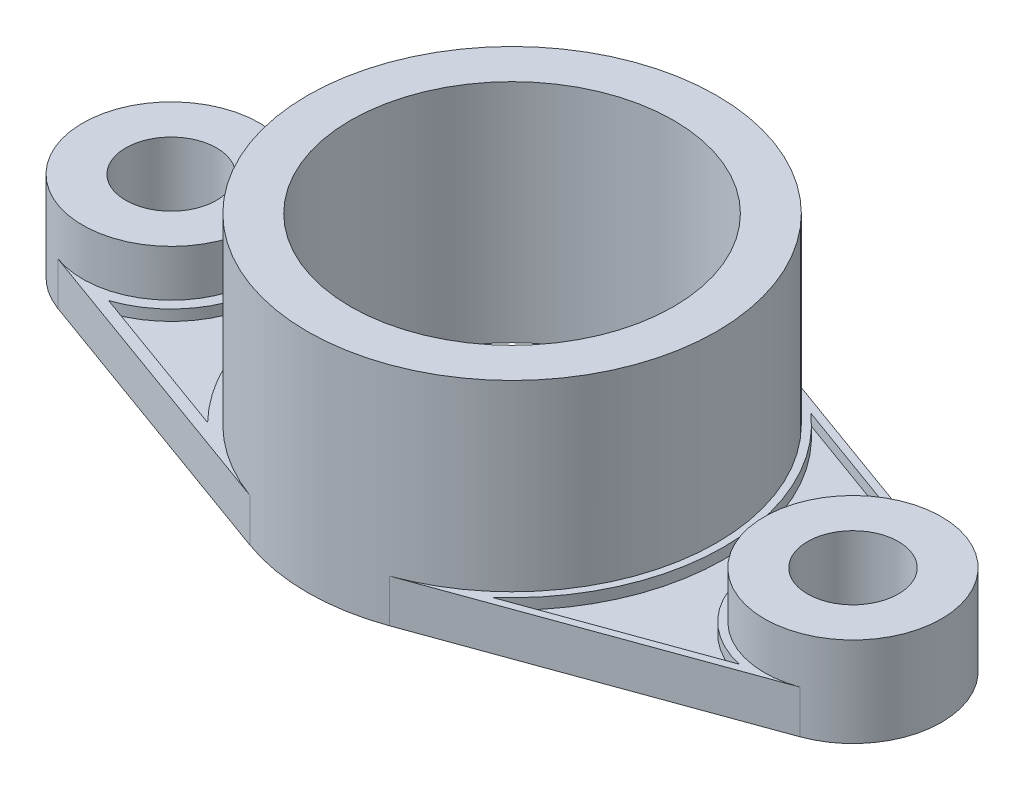
ISO-10303-21;
HEADER;
FILE_DESCRIPTION(('STEP AP214'),'2;1');
FILE_NAME('part.step','',(''),(''),'','','');
FILE_SCHEMA(('AUTOMOTIVE_DESIGN { 1 0 10303 214 1 1 1 1 }'));
ENDSEC;
DATA;
#1=APPLICATION_CONTEXT('core data for automotive mechanical design processes');
#2=APPLICATION_PROTOCOL_DEFINITION('international standard','automotive_design',2000,#1);
#3=PRODUCT_CONTEXT('',#1,'mechanical');
#4=PRODUCT('Part','Part','',(#3));
#5=PRODUCT_RELATED_PRODUCT_CATEGORY('part','',(#4));
#6=PRODUCT_DEFINITION_FORMATION('','',#4);
#7=PRODUCT_DEFINITION_CONTEXT('part definition',#1,'design');
#8=PRODUCT_DEFINITION('design','',#6,#7);
#9=PRODUCT_DEFINITION_SHAPE('','',#8);
#10=(LENGTH_UNIT() NAMED_UNIT(*) SI_UNIT(.MILLI.,.METRE.));
#11=(NAMED_UNIT(*) PLANE_ANGLE_UNIT() SI_UNIT($,.RADIAN.));
#12=(NAMED_UNIT(*) SI_UNIT($,.STERADIAN.) SOLID_ANGLE_UNIT());
#13=UNCERTAINTY_MEASURE_WITH_UNIT(LENGTH_MEASURE(1.E-05),#10,'distance_accuracy_value','');
#14=(GEOMETRIC_REPRESENTATION_CONTEXT(3) GLOBAL_UNCERTAINTY_ASSIGNED_CONTEXT((#13)) GLOBAL_UNIT_ASSIGNED_CONTEXT((#10,
#11,#12)) REPRESENTATION_CONTEXT('',''));
#15=CARTESIAN_POINT('',(0.,0.,0.));
#16=DIRECTION('',(0.,0.,1.));
#17=DIRECTION('',(1.,0.,0.));
#18=AXIS2_PLACEMENT_3D('',#15,#16,#17);
#19=CARTESIAN_POINT('',(0.,12.,0.));
#20=DIRECTION('',(0.,1.,0.));
#21=DIRECTION('',(0.,0.,1.));
#22=AXIS2_PLACEMENT_3D('',#19,#20,#21);
#23=PLANE('',#22);
#24=CARTESIAN_POINT('',(0.,12.,0.));
#25=DIRECTION('',(0.,-1.,0.));
#26=DIRECTION('',(0.,0.,1.));
#27=AXIS2_PLACEMENT_3D('',#24,#25,#26);
#28=CIRCLE('',#27,60.);
#29=CARTESIAN_POINT('',(-42.9709443550318,12.,41.8747888500558));
#30=VERTEX_POINT('',#29);
#31=CARTESIAN_POINT('',(-42.9709443550318,12.,-41.8747888500558));
#32=VERTEX_POINT('',#31);
#33=EDGE_CURVE('E54',#30,#32,#28,.T.);
#34=ORIENTED_EDGE('',*,*,#33,.F.);
#35=DIRECTION('',(0.940298506004326,0.,0.340350877192983));
#36=VECTOR('',#35,1.);
#37=CARTESIAN_POINT('',(-86.1967618123211,12.,26.228752197835));
#38=LINE('',#37,#36);
#39=CARTESIAN_POINT('',(-86.1967618123211,12.,26.228752197835));
#40=VERTEX_POINT('',#39);
#41=EDGE_CURVE('E171',#40,#30,#38,.T.);
#42=ORIENTED_EDGE('',*,*,#41,.F.);
#43=CARTESIAN_POINT('',(-95.,12.,0.));
#44=DIRECTION('',(0.,-1.,0.));
#45=DIRECTION('',(0.,0.,1.));
#46=AXIS2_PLACEMENT_3D('',#43,#44,#45);
#47=CIRCLE('',#46,27.6666666666667);
#48=CARTESIAN_POINT('',(-86.1967618123211,12.,-26.228752197835));
#49=VERTEX_POINT('',#48);
#50=EDGE_CURVE('E174',#49,#40,#47,.T.);
#51=ORIENTED_EDGE('',*,*,#50,.F.);
#52=DIRECTION('',(-0.940298506004326,0.,0.340350877192982));
#53=VECTOR('',#52,1.);
#54=CARTESIAN_POINT('',(-42.9709443550318,12.,-41.8747888500558));
#55=LINE('',#54,#53);
#56=EDGE_CURVE('E180',#32,#49,#55,.T.);
#57=ORIENTED_EDGE('',*,*,#56,.F.);
#58=EDGE_LOOP('',(#34,#42,#51,#57));
#59=FACE_BOUND('',#58,.T.);
#60=DIRECTION('',(0.940298506004326,0.,-0.340350877192982));
#61=VECTOR('',#60,1.);
#62=CARTESIAN_POINT('',(-19.4,12.,-53.5970148422466));
#63=LINE('',#62,#61);
#64=CARTESIAN_POINT('',(-103.395321637427,12.,-23.1940298147734));
#65=VERTEX_POINT('',#64);
#66=CARTESIAN_POINT('',(-19.4,12.,-53.5970148422466));
#67=VERTEX_POINT('',#66);
#68=EDGE_CURVE('E246',#65,#67,#63,.T.);
#69=ORIENTED_EDGE('',*,*,#68,.F.);
#70=CARTESIAN_POINT('',(-95.,12.,0.));
#71=DIRECTION('',(0.,1.,0.));
#72=DIRECTION('',(0.,0.,1.));
#73=AXIS2_PLACEMENT_3D('',#70,#71,#72);
#74=CIRCLE('',#73,24.6666666666667);
#75=CARTESIAN_POINT('',(-103.395321637427,12.,23.1940298147734));
#76=VERTEX_POINT('',#75);
#77=EDGE_CURVE('E11',#65,#76,#74,.F.);
#78=ORIENTED_EDGE('',*,*,#77,.T.);
#79=DIRECTION('',(0.940298506004326,0.,0.340350877192983));
#80=VECTOR('',#79,1.);
#81=CARTESIAN_POINT('',(-19.4,12.,53.5970148422466));
#82=LINE('',#81,#80);
#83=CARTESIAN_POINT('',(-19.4,12.,53.5970148422466));
#84=VERTEX_POINT('',#83);
#85=EDGE_CURVE('E250',#76,#84,#82,.T.);
#86=ORIENTED_EDGE('',*,*,#85,.T.);
#87=CARTESIAN_POINT('',(0.,12.,0.));
#88=DIRECTION('',(0.,1.,0.));
#89=DIRECTION('',(0.,0.,1.));
#90=AXIS2_PLACEMENT_3D('',#87,#88,#89);
#91=CIRCLE('',#90,57.);
#92=EDGE_CURVE('E47',#67,#84,#91,.T.);
#93=ORIENTED_EDGE('',*,*,#92,.F.);
#94=EDGE_LOOP('',(#69,#78,#86,#93));
#95=FACE_BOUND('',#94,.T.);
#96=ADVANCED_FACE('F39',(#59,#95),#23,.T.);
#97=CARTESIAN_POINT('',(0.,12.,0.));
#98=DIRECTION('',(0.,-1.,0.));
#99=DIRECTION('',(0.,0.,1.));
#100=AXIS2_PLACEMENT_3D('',#97,#98,#99);
#101=CIRCLE('',#100,59.);
#102=CARTESIAN_POINT('',(38.7985797033667,12.,-44.448511932364));
#103=VERTEX_POINT('',#102);
#104=CARTESIAN_POINT('',(38.7985797033667,12.,44.448511932364));
#105=VERTEX_POINT('',#104);
#106=EDGE_CURVE('E62',#103,#105,#101,.T.);
#107=ORIENTED_EDGE('',*,*,#106,.F.);
#108=DIRECTION('',(-0.940298506004326,0.,-0.340350877192982));
#109=VECTOR('',#108,1.);
#110=CARTESIAN_POINT('',(89.5057405715925,12.,-26.0945247982113));
#111=LINE('',#110,#109);
#112=CARTESIAN_POINT('',(89.5057405715925,12.,-26.0945247982113));
#113=VERTEX_POINT('',#112);
#114=EDGE_CURVE('E195',#113,#103,#111,.T.);
#115=ORIENTED_EDGE('',*,*,#114,.F.);
#116=CARTESIAN_POINT('',(95.,12.,0.));
#117=DIRECTION('',(0.,-1.,0.));
#118=DIRECTION('',(0.,0.,1.));
#119=AXIS2_PLACEMENT_3D('',#116,#117,#118);
#120=CIRCLE('',#119,26.6666666666667);
#121=CARTESIAN_POINT('',(89.5057405715925,12.,26.0945247982113));
#122=VERTEX_POINT('',#121);
#123=EDGE_CURVE('E209',#122,#113,#120,.T.);
#124=ORIENTED_EDGE('',*,*,#123,.F.);
#125=DIRECTION('',(0.940298506004326,0.,-0.340350877192983));
#126=VECTOR('',#125,1.);
#127=CARTESIAN_POINT('',(38.7985797033667,12.,44.448511932364));
#128=LINE('',#127,#126);
#129=EDGE_CURVE('E206',#105,#122,#128,.T.);
#130=ORIENTED_EDGE('',*,*,#129,.F.);
#131=EDGE_LOOP('',(#107,#115,#124,#130));
#132=FACE_BOUND('',#131,.T.);
#133=DIRECTION('',(0.940298506004326,0.,-0.340350877192983));
#134=VECTOR('',#133,1.);
#135=CARTESIAN_POINT('',(19.4,12.,53.5970148422466));
#136=LINE('',#135,#134);
#137=CARTESIAN_POINT('',(19.4,12.,53.5970148422466));
#138=VERTEX_POINT('',#137);
#139=CARTESIAN_POINT('',(103.395321637427,12.,23.1940298147734));
#140=VERTEX_POINT('',#139);
#141=EDGE_CURVE('E252',#138,#140,#136,.T.);
#142=ORIENTED_EDGE('',*,*,#141,.T.);
#143=CARTESIAN_POINT('',(95.,12.,0.));
#144=DIRECTION('',(0.,1.,0.));
#145=DIRECTION('',(0.,0.,1.));
#146=AXIS2_PLACEMENT_3D('',#143,#144,#145);
#147=CIRCLE('',#146,24.6666666666667);
#148=CARTESIAN_POINT('',(103.395321637427,12.,-23.1940298147734));
#149=VERTEX_POINT('',#148);
#150=EDGE_CURVE('E228',#149,#140,#147,.T.);
#151=ORIENTED_EDGE('',*,*,#150,.F.);
#152=DIRECTION('',(0.940298506004326,0.,0.340350877192983));
#153=VECTOR('',#152,1.);
#154=CARTESIAN_POINT('',(19.4,12.,-53.5970148422466));
#155=LINE('',#154,#153);
#156=CARTESIAN_POINT('',(19.4,12.,-53.5970148422466));
#157=VERTEX_POINT('',#156);
#158=EDGE_CURVE('E244',#157,#149,#155,.T.);
#159=ORIENTED_EDGE('',*,*,#158,.F.);
#160=EDGE_CURVE('E237',#138,#157,#91,.T.);
#161=ORIENTED_EDGE('',*,*,#160,.F.);
#162=EDGE_LOOP('',(#142,#151,#159,#161));
#163=FACE_BOUND('',#162,.T.);
#164=ADVANCED_FACE('F329',(#132,#163),#23,.T.);
#165=CARTESIAN_POINT('',(95.,12.,0.));
#166=DIRECTION('',(0.,-1.,0.));
#167=DIRECTION('',(0.,0.,-1.));
#168=AXIS2_PLACEMENT_3D('',#165,#166,#167);
#169=CYLINDRICAL_SURFACE('',#168,24.6666666666667);
#170=CARTESIAN_POINT('',(95.,0.,0.));
#171=DIRECTION('',(0.,1.,0.));
#172=DIRECTION('',(0.,0.,1.));
#173=AXIS2_PLACEMENT_3D('',#170,#171,#172);
#174=CIRCLE('',#173,24.6666666666667);
#175=CARTESIAN_POINT('',(103.395321637427,0.,23.1940298147734));
#176=VERTEX_POINT('',#175);
#177=CARTESIAN_POINT('',(103.395321637427,0.,-23.1940298147734));
#178=VERTEX_POINT('',#177);
#179=EDGE_CURVE('E257',#176,#178,#174,.T.);
#180=ORIENTED_EDGE('',*,*,#179,.T.);
#181=DIRECTION('',(0.,-1.,0.));
#182=VECTOR('',#181,1.);
#183=CARTESIAN_POINT('',(103.395321637427,12.,-23.1940298147734));
#184=LINE('',#183,#182);
#185=EDGE_CURVE('E297',#149,#178,#184,.T.);
#186=ORIENTED_EDGE('',*,*,#185,.F.);
#187=ORIENTED_EDGE('',*,*,#150,.T.);
#188=DIRECTION('',(0.,-1.,0.));
#189=VECTOR('',#188,1.);
#190=CARTESIAN_POINT('',(103.395321637427,12.,23.1940298147734));
#191=LINE('',#190,#189);
#192=EDGE_CURVE('E254',#140,#176,#191,.T.);
#193=ORIENTED_EDGE('',*,*,#192,.T.);
#194=EDGE_LOOP('',(#180,#186,#187,#193));
#195=FACE_BOUND('',#194,.T.);
#196=CARTESIAN_POINT('',(95.,25.,0.));
#197=DIRECTION('',(0.,1.,0.));
#198=DIRECTION('',(0.,0.,1.));
#199=AXIS2_PLACEMENT_3D('',#196,#197,#198);
#200=CIRCLE('',#199,24.6666666666667);
#201=CARTESIAN_POINT('',(95.,25.,24.6666666666667));
#202=VERTEX_POINT('',#201);
#203=EDGE_CURVE('E229',#202,#202,#200,.T.);
#204=ORIENTED_EDGE('',*,*,#203,.F.);
#205=EDGE_LOOP('',(#204));
#206=FACE_BOUND('',#205,.T.);
#207=ADVANCED_FACE('F335',(#195,#206),#169,.T.);
#208=CARTESIAN_POINT('',(19.4,12.,-53.5970148422466));
#209=DIRECTION('',(0.340350877192983,0.,-0.940298506004326));
#210=DIRECTION('',(-0.940298506004326,0.,-0.340350877192983));
#211=AXIS2_PLACEMENT_3D('',#208,#209,#210);
#212=PLANE('',#211);
#213=DIRECTION('',(0.940298506004326,0.,0.340350877192983));
#214=VECTOR('',#213,1.);
#215=CARTESIAN_POINT('',(19.4,0.,-53.5970148422466));
#216=LINE('',#215,#214);
#217=CARTESIAN_POINT('',(19.4,0.,-53.5970148422466));
#218=VERTEX_POINT('',#217);
#219=EDGE_CURVE('E260',#218,#178,#216,.T.);
#220=ORIENTED_EDGE('',*,*,#219,.F.);
#221=DIRECTION('',(0.,-1.,0.));
#222=VECTOR('',#221,1.);
#223=CARTESIAN_POINT('',(19.4,12.,-53.5970148422466));
#224=LINE('',#223,#222);
#225=EDGE_CURVE('E296',#157,#218,#224,.T.);
#226=ORIENTED_EDGE('',*,*,#225,.F.);
#227=ORIENTED_EDGE('',*,*,#158,.T.);
#228=ORIENTED_EDGE('',*,*,#185,.T.);
#229=EDGE_LOOP('',(#220,#226,#227,#228));
#230=FACE_BOUND('',#229,.T.);
#231=ADVANCED_FACE('F332',(#230),#212,.T.);
#232=CARTESIAN_POINT('',(-19.4,12.,-53.5970148422466));
#233=DIRECTION('',(-0.340350877192982,0.,-0.940298506004326));
#234=DIRECTION('',(-0.940298506004326,0.,0.340350877192982));
#235=AXIS2_PLACEMENT_3D('',#232,#233,#234);
#236=PLANE('',#235);
#237=DIRECTION('',(0.940298506004326,0.,-0.340350877192982));
#238=VECTOR('',#237,1.);
#239=CARTESIAN_POINT('',(-19.4,0.,-53.5970148422466));
#240=LINE('',#239,#238);
#241=CARTESIAN_POINT('',(-103.395321637427,0.,-23.1940298147734));
#242=VERTEX_POINT('',#241);
#243=CARTESIAN_POINT('',(-19.4,0.,-53.5970148422466));
#244=VERTEX_POINT('',#243);
#245=EDGE_CURVE('E266',#242,#244,#240,.T.);
#246=ORIENTED_EDGE('',*,*,#245,.F.);
#247=DIRECTION('',(0.,-1.,0.));
#248=VECTOR('',#247,1.);
#249=CARTESIAN_POINT('',(-103.395321637427,12.,-23.1940298147734));
#250=LINE('',#249,#248);
#251=EDGE_CURVE('E292',#65,#242,#250,.T.);
#252=ORIENTED_EDGE('',*,*,#251,.F.);
#253=ORIENTED_EDGE('',*,*,#68,.T.);
#254=DIRECTION('',(0.,-1.,0.));
#255=VECTOR('',#254,1.);
#256=CARTESIAN_POINT('',(-19.4,12.,-53.5970148422466));
#257=LINE('',#256,#255);
#258=EDGE_CURVE('E294',#67,#244,#257,.T.);
#259=ORIENTED_EDGE('',*,*,#258,.T.);
#260=EDGE_LOOP('',(#246,#252,#253,#259));
#261=FACE_BOUND('',#260,.T.);
#262=ADVANCED_FACE('F334',(#261),#236,.T.);
#263=CARTESIAN_POINT('',(-95.,12.,0.));
#264=DIRECTION('',(0.,-1.,0.));
#265=DIRECTION('',(0.,0.,-1.));
#266=AXIS2_PLACEMENT_3D('',#263,#264,#265);
#267=CYLINDRICAL_SURFACE('',#266,24.6666666666667);
#268=CARTESIAN_POINT('',(-95.,0.,0.));
#269=DIRECTION('',(0.,1.,0.));
#270=DIRECTION('',(0.,0.,1.));
#271=AXIS2_PLACEMENT_3D('',#268,#269,#270);
#272=CIRCLE('',#271,24.6666666666667);
#273=CARTESIAN_POINT('',(-103.395321637427,0.,23.1940298147734));
#274=VERTEX_POINT('',#273);
#275=EDGE_CURVE('E270',#242,#274,#272,.T.);
#276=ORIENTED_EDGE('',*,*,#275,.T.);
#277=DIRECTION('',(0.,-1.,0.));
#278=VECTOR('',#277,1.);
#279=CARTESIAN_POINT('',(-103.395321637427,12.,23.1940298147734));
#280=LINE('',#279,#278);
#281=EDGE_CURVE('E289',#76,#274,#280,.T.);
#282=ORIENTED_EDGE('',*,*,#281,.F.);
#283=ORIENTED_EDGE('',*,*,#77,.F.);
#284=ORIENTED_EDGE('',*,*,#251,.T.);
#285=EDGE_LOOP('',(#276,#282,#283,#284));
#286=FACE_BOUND('',#285,.T.);
#287=CARTESIAN_POINT('',(-95.,25.,0.));
#288=DIRECTION('',(0.,1.,0.));
#289=DIRECTION('',(0.,0.,-1.));
#290=AXIS2_PLACEMENT_3D('',#287,#288,#289);
#291=CIRCLE('',#290,24.6666666666667);
#292=CARTESIAN_POINT('',(-95.,25.,-24.6666666666667));
#293=VERTEX_POINT('',#292);
#294=EDGE_CURVE('E222',#293,#293,#291,.T.);
#295=ORIENTED_EDGE('',*,*,#294,.F.);
#296=EDGE_LOOP('',(#295));
#297=FACE_BOUND('',#296,.T.);
#298=ADVANCED_FACE('F341',(#286,#297),#267,.T.);
#299=CARTESIAN_POINT('',(-19.4,12.,53.5970148422466));
#300=DIRECTION('',(0.340350877192983,0.,-0.940298506004326));
#301=DIRECTION('',(-0.940298506004326,0.,-0.340350877192983));
#302=AXIS2_PLACEMENT_3D('',#299,#300,#301);
#303=PLANE('',#302);
#304=DIRECTION('',(0.940298506004326,0.,0.340350877192983));
#305=VECTOR('',#304,1.);
#306=CARTESIAN_POINT('',(-19.4,0.,53.5970148422466));
#307=LINE('',#306,#305);
#308=CARTESIAN_POINT('',(-19.4,0.,53.5970148422466));
#309=VERTEX_POINT('',#308);
#310=EDGE_CURVE('E272',#274,#309,#307,.T.);
#311=ORIENTED_EDGE('',*,*,#310,.T.);
#312=DIRECTION('',(0.,-1.,0.));
#313=VECTOR('',#312,1.);
#314=CARTESIAN_POINT('',(-19.4,12.,53.5970148422466));
#315=LINE('',#314,#313);
#316=EDGE_CURVE('E286',#84,#309,#315,.T.);
#317=ORIENTED_EDGE('',*,*,#316,.F.);
#318=ORIENTED_EDGE('',*,*,#85,.F.);
#319=ORIENTED_EDGE('',*,*,#281,.T.);
#320=EDGE_LOOP('',(#311,#317,#318,#319));
#321=FACE_BOUND('',#320,.T.);
#322=ADVANCED_FACE('F313',(#321),#303,.F.);
#323=CARTESIAN_POINT('',(0.,12.,0.));
#324=DIRECTION('',(0.,-1.,0.));
#325=DIRECTION('',(0.,0.,-1.));
#326=AXIS2_PLACEMENT_3D('',#323,#324,#325);
#327=CYLINDRICAL_SURFACE('',#326,57.);
#328=CARTESIAN_POINT('',(0.,0.,0.));
#329=DIRECTION('',(0.,1.,0.));
#330=DIRECTION('',(0.,0.,1.));
#331=AXIS2_PLACEMENT_3D('',#328,#329,#330);
#332=CIRCLE('',#331,57.);
#333=CARTESIAN_POINT('',(19.4,0.,53.5970148422466));
#334=VERTEX_POINT('',#333);
#335=EDGE_CURVE('E267',#309,#334,#332,.T.);
#336=ORIENTED_EDGE('',*,*,#335,.T.);
#337=DIRECTION('',(0.,-1.,0.));
#338=VECTOR('',#337,1.);
#339=CARTESIAN_POINT('',(19.4,12.,53.5970148422466));
#340=LINE('',#339,#338);
#341=EDGE_CURVE('E283',#138,#334,#340,.T.);
#342=ORIENTED_EDGE('',*,*,#341,.F.);
#343=ORIENTED_EDGE('',*,*,#160,.T.);
#344=ORIENTED_EDGE('',*,*,#225,.T.);
#345=EDGE_CURVE('E263',#218,#244,#332,.T.);
#346=ORIENTED_EDGE('',*,*,#345,.T.);
#347=ORIENTED_EDGE('',*,*,#258,.F.);
#348=ORIENTED_EDGE('',*,*,#92,.T.);
#349=ORIENTED_EDGE('',*,*,#316,.T.);
#350=EDGE_LOOP('',(#336,#342,#343,#344,#346,#347,#348,#349));
#351=FACE_BOUND('',#350,.T.);
#352=CARTESIAN_POINT('',(0.,63.,0.));
#353=DIRECTION('',(0.,1.,0.));
#354=DIRECTION('',(0.,0.,1.));
#355=AXIS2_PLACEMENT_3D('',#352,#353,#354);
#356=CIRCLE('',#355,57.);
#357=CARTESIAN_POINT('',(0.,63.,57.));
#358=VERTEX_POINT('',#357);
#359=EDGE_CURVE('E238',#358,#358,#356,.T.);
#360=ORIENTED_EDGE('',*,*,#359,.F.);
#361=EDGE_LOOP('',(#360));
#362=FACE_BOUND('',#361,.T.);
#363=ADVANCED_FACE('F304',(#351,#362),#327,.T.);
#364=CARTESIAN_POINT('',(0.,12.,0.));
#365=DIRECTION('',(0.,-1.,0.));
#366=DIRECTION('',(0.,0.,-1.));
#367=AXIS2_PLACEMENT_3D('',#364,#365,#366);
#368=CYLINDRICAL_SURFACE('',#367,45.);
#369=CARTESIAN_POINT('',(0.,0.,0.));
#370=DIRECTION('',(0.,1.,0.));
#371=DIRECTION('',(0.,0.,1.));
#372=AXIS2_PLACEMENT_3D('',#369,#370,#371);
#373=CIRCLE('',#372,45.);
#374=CARTESIAN_POINT('',(0.,0.,45.));
#375=VERTEX_POINT('',#374);
#376=EDGE_CURVE('E276',#375,#375,#373,.T.);
#377=ORIENTED_EDGE('',*,*,#376,.F.);
#378=EDGE_LOOP('',(#377));
#379=FACE_BOUND('',#378,.T.);
#380=CARTESIAN_POINT('',(0.,63.,0.));
#381=DIRECTION('',(0.,1.,0.));
#382=DIRECTION('',(0.,0.,1.));
#383=AXIS2_PLACEMENT_3D('',#380,#381,#382);
#384=CIRCLE('',#383,45.);
#385=CARTESIAN_POINT('',(0.,63.,45.));
#386=VERTEX_POINT('',#385);
#387=EDGE_CURVE('E232',#386,#386,#384,.T.);
#388=ORIENTED_EDGE('',*,*,#387,.T.);
#389=EDGE_LOOP('',(#388));
#390=FACE_BOUND('',#389,.T.);
#391=ADVANCED_FACE('F363',(#379,#390),#368,.F.);
#392=CARTESIAN_POINT('',(19.4,12.,53.5970148422466));
#393=DIRECTION('',(-0.340350877192983,0.,-0.940298506004326));
#394=DIRECTION('',(-0.940298506004326,0.,0.340350877192983));
#395=AXIS2_PLACEMENT_3D('',#392,#393,#394);
#396=PLANE('',#395);
#397=DIRECTION('',(0.940298506004326,0.,-0.340350877192983));
#398=VECTOR('',#397,1.);
#399=CARTESIAN_POINT('',(19.4,0.,53.5970148422466));
#400=LINE('',#399,#398);
#401=EDGE_CURVE('E274',#334,#176,#400,.T.);
#402=ORIENTED_EDGE('',*,*,#401,.T.);
#403=ORIENTED_EDGE('',*,*,#192,.F.);
#404=ORIENTED_EDGE('',*,*,#141,.F.);
#405=ORIENTED_EDGE('',*,*,#341,.T.);
#406=EDGE_LOOP('',(#402,#403,#404,#405));
#407=FACE_BOUND('',#406,.T.);
#408=ADVANCED_FACE('F325',(#407),#396,.F.);
#409=CARTESIAN_POINT('',(95.,12.,0.));
#410=DIRECTION('',(0.,-1.,0.));
#411=DIRECTION('',(0.,0.,-1.));
#412=AXIS2_PLACEMENT_3D('',#409,#410,#411);
#413=CYLINDRICAL_SURFACE('',#412,12.6666666666667);
#414=CARTESIAN_POINT('',(95.,0.,0.));
#415=DIRECTION('',(0.,1.,0.));
#416=DIRECTION('',(0.,0.,1.));
#417=AXIS2_PLACEMENT_3D('',#414,#415,#416);
#418=CIRCLE('',#417,12.6666666666667);
#419=CARTESIAN_POINT('',(95.,0.,12.6666666666667));
#420=VERTEX_POINT('',#419);
#421=EDGE_CURVE('E241',#420,#420,#418,.T.);
#422=ORIENTED_EDGE('',*,*,#421,.F.);
#423=EDGE_LOOP('',(#422));
#424=FACE_BOUND('',#423,.T.);
#425=CARTESIAN_POINT('',(95.,25.,0.));
#426=DIRECTION('',(0.,1.,0.));
#427=DIRECTION('',(0.,0.,1.));
#428=AXIS2_PLACEMENT_3D('',#425,#426,#427);
#429=CIRCLE('',#428,12.6666666666667);
#430=CARTESIAN_POINT('',(95.,25.,12.6666666666667));
#431=VERTEX_POINT('',#430);
#432=EDGE_CURVE('E225',#431,#431,#429,.T.);
#433=ORIENTED_EDGE('',*,*,#432,.T.);
#434=EDGE_LOOP('',(#433));
#435=FACE_BOUND('',#434,.T.);
#436=ADVANCED_FACE('F41',(#424,#435),#413,.F.);
#437=CARTESIAN_POINT('',(-95.,12.,0.));
#438=DIRECTION('',(0.,-1.,0.));
#439=DIRECTION('',(0.,0.,-1.));
#440=AXIS2_PLACEMENT_3D('',#437,#438,#439);
#441=CYLINDRICAL_SURFACE('',#440,12.6666666666667);
#442=CARTESIAN_POINT('',(-95.,0.,0.));
#443=DIRECTION('',(0.,1.,0.));
#444=DIRECTION('',(0.,0.,1.));
#445=AXIS2_PLACEMENT_3D('',#442,#443,#444);
#446=CIRCLE('',#445,12.6666666666667);
#447=CARTESIAN_POINT('',(-95.,0.,12.6666666666667));
#448=VERTEX_POINT('',#447);
#449=EDGE_CURVE('E247',#448,#448,#446,.T.);
#450=ORIENTED_EDGE('',*,*,#449,.F.);
#451=EDGE_LOOP('',(#450));
#452=FACE_BOUND('',#451,.T.);
#453=CARTESIAN_POINT('',(-95.,25.,0.));
#454=DIRECTION('',(0.,1.,0.));
#455=DIRECTION('',(0.,0.,-1.));
#456=AXIS2_PLACEMENT_3D('',#453,#454,#455);
#457=CIRCLE('',#456,12.6666666666667);
#458=CARTESIAN_POINT('',(-95.,25.,-12.6666666666667));
#459=VERTEX_POINT('',#458);
#460=EDGE_CURVE('E187',#459,#459,#457,.T.);
#461=ORIENTED_EDGE('',*,*,#460,.T.);
#462=EDGE_LOOP('',(#461));
#463=FACE_BOUND('',#462,.T.);
#464=ADVANCED_FACE('F358',(#452,#463),#441,.F.);
#465=CARTESIAN_POINT('',(0.,0.,0.));
#466=DIRECTION('',(0.,1.,0.));
#467=DIRECTION('',(0.,0.,1.));
#468=AXIS2_PLACEMENT_3D('',#465,#466,#467);
#469=PLANE('',#468);
#470=ORIENTED_EDGE('',*,*,#421,.T.);
#471=EDGE_LOOP('',(#470));
#472=FACE_BOUND('',#471,.T.);
#473=ORIENTED_EDGE('',*,*,#179,.F.);
#474=ORIENTED_EDGE('',*,*,#401,.F.);
#475=ORIENTED_EDGE('',*,*,#335,.F.);
#476=ORIENTED_EDGE('',*,*,#310,.F.);
#477=ORIENTED_EDGE('',*,*,#275,.F.);
#478=ORIENTED_EDGE('',*,*,#245,.T.);
#479=ORIENTED_EDGE('',*,*,#345,.F.);
#480=ORIENTED_EDGE('',*,*,#219,.T.);
#481=EDGE_LOOP('',(#473,#474,#475,#476,#477,#478,#479,#480));
#482=FACE_BOUND('',#481,.T.);
#483=ORIENTED_EDGE('',*,*,#376,.T.);
#484=EDGE_LOOP('',(#483));
#485=FACE_BOUND('',#484,.T.);
#486=ORIENTED_EDGE('',*,*,#449,.T.);
#487=EDGE_LOOP('',(#486));
#488=FACE_BOUND('',#487,.T.);
#489=ADVANCED_FACE('F318',(#472,#482,#485,#488),#469,.F.);
#490=CARTESIAN_POINT('',(0.,63.,0.));
#491=DIRECTION('',(0.,1.,0.));
#492=DIRECTION('',(0.,0.,1.));
#493=AXIS2_PLACEMENT_3D('',#490,#491,#492);
#494=PLANE('',#493);
#495=ORIENTED_EDGE('',*,*,#359,.T.);
#496=EDGE_LOOP('',(#495));
#497=FACE_BOUND('',#496,.T.);
#498=ORIENTED_EDGE('',*,*,#387,.F.);
#499=EDGE_LOOP('',(#498));
#500=FACE_BOUND('',#499,.T.);
#501=ADVANCED_FACE('F354',(#497,#500),#494,.T.);
#502=CARTESIAN_POINT('',(95.,25.,0.));
#503=DIRECTION('',(0.,1.,0.));
#504=DIRECTION('',(0.,0.,1.));
#505=AXIS2_PLACEMENT_3D('',#502,#503,#504);
#506=PLANE('',#505);
#507=ORIENTED_EDGE('',*,*,#203,.T.);
#508=EDGE_LOOP('',(#507));
#509=FACE_BOUND('',#508,.T.);
#510=ORIENTED_EDGE('',*,*,#432,.F.);
#511=EDGE_LOOP('',(#510));
#512=FACE_BOUND('',#511,.T.);
#513=ADVANCED_FACE('F384',(#509,#512),#506,.T.);
#514=CARTESIAN_POINT('',(-95.,25.,0.));
#515=DIRECTION('',(0.,-1.,0.));
#516=DIRECTION('',(0.,0.,-1.));
#517=AXIS2_PLACEMENT_3D('',#514,#515,#516);
#518=PLANE('',#517);
#519=ORIENTED_EDGE('',*,*,#294,.T.);
#520=EDGE_LOOP('',(#519));
#521=FACE_BOUND('',#520,.T.);
#522=ORIENTED_EDGE('',*,*,#460,.F.);
#523=EDGE_LOOP('',(#522));
#524=FACE_BOUND('',#523,.T.);
#525=ADVANCED_FACE('F380',(#521,#524),#518,.F.);
#526=CARTESIAN_POINT('',(0.,9.,0.));
#527=DIRECTION('',(0.,1.,0.));
#528=DIRECTION('',(0.,0.,1.));
#529=AXIS2_PLACEMENT_3D('',#526,#527,#528);
#530=CYLINDRICAL_SURFACE('',#529,59.);
#531=ORIENTED_EDGE('',*,*,#106,.T.);
#532=DIRECTION('',(0.,1.,0.));
#533=VECTOR('',#532,1.);
#534=CARTESIAN_POINT('',(38.7985797033667,9.,44.448511932364));
#535=LINE('',#534,#533);
#536=CARTESIAN_POINT('',(38.7985797033667,9.,44.448511932364));
#537=VERTEX_POINT('',#536);
#538=EDGE_CURVE('E204',#537,#105,#535,.T.);
#539=ORIENTED_EDGE('',*,*,#538,.F.);
#540=CARTESIAN_POINT('',(0.,9.,0.));
#541=DIRECTION('',(0.,-1.,0.));
#542=DIRECTION('',(0.,0.,1.));
#543=AXIS2_PLACEMENT_3D('',#540,#541,#542);
#544=CIRCLE('',#543,59.);
#545=CARTESIAN_POINT('',(38.7985797033667,9.,-44.448511932364));
#546=VERTEX_POINT('',#545);
#547=EDGE_CURVE('E191',#546,#537,#544,.T.);
#548=ORIENTED_EDGE('',*,*,#547,.F.);
#549=DIRECTION('',(0.,1.,0.));
#550=VECTOR('',#549,1.);
#551=CARTESIAN_POINT('',(38.7985797033667,9.,-44.448511932364));
#552=LINE('',#551,#550);
#553=EDGE_CURVE('E181',#546,#103,#552,.T.);
#554=ORIENTED_EDGE('',*,*,#553,.T.);
#555=EDGE_LOOP('',(#531,#539,#548,#554));
#556=FACE_BOUND('',#555,.T.);
#557=ADVANCED_FACE('F383',(#556),#530,.T.);
#558=CARTESIAN_POINT('',(89.5057405715925,9.,-26.0945247982113));
#559=DIRECTION('',(0.340350877192983,0.,-0.940298506004326));
#560=DIRECTION('',(-0.940298506004326,0.,-0.340350877192983));
#561=AXIS2_PLACEMENT_3D('',#558,#559,#560);
#562=PLANE('',#561);
#563=ORIENTED_EDGE('',*,*,#114,.T.);
#564=ORIENTED_EDGE('',*,*,#553,.F.);
#565=DIRECTION('',(-0.940298506004326,0.,-0.340350877192982));
#566=VECTOR('',#565,1.);
#567=CARTESIAN_POINT('',(89.5057405715925,9.,-26.0945247982113));
#568=LINE('',#567,#566);
#569=CARTESIAN_POINT('',(89.5057405715925,9.,-26.0945247982113));
#570=VERTEX_POINT('',#569);
#571=EDGE_CURVE('E201',#570,#546,#568,.T.);
#572=ORIENTED_EDGE('',*,*,#571,.F.);
#573=DIRECTION('',(0.,1.,0.));
#574=VECTOR('',#573,1.);
#575=CARTESIAN_POINT('',(89.5057405715925,9.,-26.0945247982113));
#576=LINE('',#575,#574);
#577=EDGE_CURVE('E215',#570,#113,#576,.T.);
#578=ORIENTED_EDGE('',*,*,#577,.T.);
#579=EDGE_LOOP('',(#563,#564,#572,#578));
#580=FACE_BOUND('',#579,.T.);
#581=ADVANCED_FACE('F392',(#580),#562,.F.);
#582=CARTESIAN_POINT('',(95.,9.,0.));
#583=DIRECTION('',(0.,1.,0.));
#584=DIRECTION('',(0.,0.,1.));
#585=AXIS2_PLACEMENT_3D('',#582,#583,#584);
#586=CYLINDRICAL_SURFACE('',#585,26.6666666666667);
#587=ORIENTED_EDGE('',*,*,#123,.T.);
#588=ORIENTED_EDGE('',*,*,#577,.F.);
#589=CARTESIAN_POINT('',(95.,9.,0.));
#590=DIRECTION('',(0.,-1.,0.));
#591=DIRECTION('',(0.,0.,1.));
#592=AXIS2_PLACEMENT_3D('',#589,#590,#591);
#593=CIRCLE('',#592,26.6666666666667);
#594=CARTESIAN_POINT('',(89.5057405715925,9.,26.0945247982113));
#595=VERTEX_POINT('',#594);
#596=EDGE_CURVE('E198',#595,#570,#593,.T.);
#597=ORIENTED_EDGE('',*,*,#596,.F.);
#598=DIRECTION('',(0.,1.,0.));
#599=VECTOR('',#598,1.);
#600=CARTESIAN_POINT('',(89.5057405715925,9.,26.0945247982113));
#601=LINE('',#600,#599);
#602=EDGE_CURVE('E217',#595,#122,#601,.T.);
#603=ORIENTED_EDGE('',*,*,#602,.T.);
#604=EDGE_LOOP('',(#587,#588,#597,#603));
#605=FACE_BOUND('',#604,.T.);
#606=ADVANCED_FACE('F400',(#605),#586,.T.);
#607=CARTESIAN_POINT('',(38.7985797033667,9.,44.448511932364));
#608=DIRECTION('',(0.340350877192983,0.,0.940298506004326));
#609=DIRECTION('',(0.940298506004326,0.,-0.340350877192983));
#610=AXIS2_PLACEMENT_3D('',#607,#608,#609);
#611=PLANE('',#610);
#612=ORIENTED_EDGE('',*,*,#129,.T.);
#613=ORIENTED_EDGE('',*,*,#602,.F.);
#614=DIRECTION('',(0.940298506004326,0.,-0.340350877192983));
#615=VECTOR('',#614,1.);
#616=CARTESIAN_POINT('',(38.7985797033667,9.,44.448511932364));
#617=LINE('',#616,#615);
#618=EDGE_CURVE('E194',#537,#595,#617,.T.);
#619=ORIENTED_EDGE('',*,*,#618,.F.);
#620=ORIENTED_EDGE('',*,*,#538,.T.);
#621=EDGE_LOOP('',(#612,#613,#619,#620));
#622=FACE_BOUND('',#621,.T.);
#623=ADVANCED_FACE('F396',(#622),#611,.F.);
#624=CARTESIAN_POINT('',(0.,9.,0.));
#625=DIRECTION('',(0.,1.,0.));
#626=DIRECTION('',(0.,0.,1.));
#627=AXIS2_PLACEMENT_3D('',#624,#625,#626);
#628=PLANE('',#627);
#629=ORIENTED_EDGE('',*,*,#547,.T.);
#630=ORIENTED_EDGE('',*,*,#618,.T.);
#631=ORIENTED_EDGE('',*,*,#596,.T.);
#632=ORIENTED_EDGE('',*,*,#571,.T.);
#633=EDGE_LOOP('',(#629,#630,#631,#632));
#634=FACE_BOUND('',#633,.T.);
#635=ADVANCED_FACE('F399',(#634),#628,.T.);
#636=CARTESIAN_POINT('',(0.,9.,0.));
#637=DIRECTION('',(0.,1.,0.));
#638=DIRECTION('',(0.,0.,1.));
#639=AXIS2_PLACEMENT_3D('',#636,#637,#638);
#640=CYLINDRICAL_SURFACE('',#639,60.);
#641=ORIENTED_EDGE('',*,*,#33,.T.);
#642=DIRECTION('',(0.,1.,0.));
#643=VECTOR('',#642,1.);
#644=CARTESIAN_POINT('',(-42.9709443550318,9.,-41.8747888500558));
#645=LINE('',#644,#643);
#646=CARTESIAN_POINT('',(-42.9709443550318,9.,-41.8747888500558));
#647=VERTEX_POINT('',#646);
#648=EDGE_CURVE('E149',#647,#32,#645,.T.);
#649=ORIENTED_EDGE('',*,*,#648,.F.);
#650=CARTESIAN_POINT('',(0.,9.,0.));
#651=DIRECTION('',(0.,-1.,0.));
#652=DIRECTION('',(0.,0.,1.));
#653=AXIS2_PLACEMENT_3D('',#650,#651,#652);
#654=CIRCLE('',#653,60.);
#655=CARTESIAN_POINT('',(-42.9709443550318,9.,41.8747888500558));
#656=VERTEX_POINT('',#655);
#657=EDGE_CURVE('E153',#656,#647,#654,.T.);
#658=ORIENTED_EDGE('',*,*,#657,.F.);
#659=DIRECTION('',(0.,1.,0.));
#660=VECTOR('',#659,1.);
#661=CARTESIAN_POINT('',(-42.9709443550318,9.,41.8747888500558));
#662=LINE('',#661,#660);
#663=EDGE_CURVE('E185',#656,#30,#662,.T.);
#664=ORIENTED_EDGE('',*,*,#663,.T.);
#665=EDGE_LOOP('',(#641,#649,#658,#664));
#666=FACE_BOUND('',#665,.T.);
#667=ADVANCED_FACE('F151',(#666),#640,.T.);
#668=CARTESIAN_POINT('',(-86.1967618123211,9.,26.228752197835));
#669=DIRECTION('',(-0.340350877192983,0.,0.940298506004326));
#670=DIRECTION('',(0.940298506004326,0.,0.340350877192983));
#671=AXIS2_PLACEMENT_3D('',#668,#669,#670);
#672=PLANE('',#671);
#673=ORIENTED_EDGE('',*,*,#41,.T.);
#674=ORIENTED_EDGE('',*,*,#663,.F.);
#675=DIRECTION('',(0.940298506004326,0.,0.340350877192983));
#676=VECTOR('',#675,1.);
#677=CARTESIAN_POINT('',(-86.1967618123211,9.,26.228752197835));
#678=LINE('',#677,#676);
#679=CARTESIAN_POINT('',(-86.1967618123211,9.,26.228752197835));
#680=VERTEX_POINT('',#679);
#681=EDGE_CURVE('E159',#680,#656,#678,.T.);
#682=ORIENTED_EDGE('',*,*,#681,.F.);
#683=DIRECTION('',(0.,1.,0.));
#684=VECTOR('',#683,1.);
#685=CARTESIAN_POINT('',(-86.1967618123211,9.,26.228752197835));
#686=LINE('',#685,#684);
#687=EDGE_CURVE('E188',#680,#40,#686,.T.);
#688=ORIENTED_EDGE('',*,*,#687,.T.);
#689=EDGE_LOOP('',(#673,#674,#682,#688));
#690=FACE_BOUND('',#689,.T.);
#691=ADVANCED_FACE('F413',(#690),#672,.F.);
#692=CARTESIAN_POINT('',(-95.,9.,0.));
#693=DIRECTION('',(0.,1.,0.));
#694=DIRECTION('',(0.,0.,1.));
#695=AXIS2_PLACEMENT_3D('',#692,#693,#694);
#696=CYLINDRICAL_SURFACE('',#695,27.6666666666667);
#697=ORIENTED_EDGE('',*,*,#50,.T.);
#698=ORIENTED_EDGE('',*,*,#687,.F.);
#699=CARTESIAN_POINT('',(-95.,9.,0.));
#700=DIRECTION('',(0.,-1.,0.));
#701=DIRECTION('',(0.,0.,1.));
#702=AXIS2_PLACEMENT_3D('',#699,#700,#701);
#703=CIRCLE('',#702,27.6666666666667);
#704=CARTESIAN_POINT('',(-86.1967618123211,9.,-26.228752197835));
#705=VERTEX_POINT('',#704);
#706=EDGE_CURVE('E167',#705,#680,#703,.T.);
#707=ORIENTED_EDGE('',*,*,#706,.F.);
#708=DIRECTION('',(0.,1.,0.));
#709=VECTOR('',#708,1.);
#710=CARTESIAN_POINT('',(-86.1967618123211,9.,-26.228752197835));
#711=LINE('',#710,#709);
#712=EDGE_CURVE('E158',#705,#49,#711,.T.);
#713=ORIENTED_EDGE('',*,*,#712,.T.);
#714=EDGE_LOOP('',(#697,#698,#707,#713));
#715=FACE_BOUND('',#714,.T.);
#716=ADVANCED_FACE('F416',(#715),#696,.T.);
#717=CARTESIAN_POINT('',(-42.9709443550318,9.,-41.8747888500558));
#718=DIRECTION('',(-0.340350877192982,0.,-0.940298506004326));
#719=DIRECTION('',(-0.940298506004326,0.,0.340350877192982));
#720=AXIS2_PLACEMENT_3D('',#717,#718,#719);
#721=PLANE('',#720);
#722=ORIENTED_EDGE('',*,*,#56,.T.);
#723=ORIENTED_EDGE('',*,*,#712,.F.);
#724=DIRECTION('',(-0.940298506004326,0.,0.340350877192982));
#725=VECTOR('',#724,1.);
#726=CARTESIAN_POINT('',(-42.9709443550318,9.,-41.8747888500558));
#727=LINE('',#726,#725);
#728=EDGE_CURVE('E162',#647,#705,#727,.T.);
#729=ORIENTED_EDGE('',*,*,#728,.F.);
#730=ORIENTED_EDGE('',*,*,#648,.T.);
#731=EDGE_LOOP('',(#722,#723,#729,#730));
#732=FACE_BOUND('',#731,.T.);
#733=ADVANCED_FACE('F163',(#732),#721,.F.);
#734=CARTESIAN_POINT('',(0.,9.,0.));
#735=DIRECTION('',(0.,1.,0.));
#736=DIRECTION('',(0.,0.,1.));
#737=AXIS2_PLACEMENT_3D('',#734,#735,#736);
#738=PLANE('',#737);
#739=ORIENTED_EDGE('',*,*,#657,.T.);
#740=ORIENTED_EDGE('',*,*,#728,.T.);
#741=ORIENTED_EDGE('',*,*,#706,.T.);
#742=ORIENTED_EDGE('',*,*,#681,.T.);
#743=EDGE_LOOP('',(#739,#740,#741,#742));
#744=FACE_BOUND('',#743,.T.);
#745=ADVANCED_FACE('F169',(#744),#738,.T.);
#746=CLOSED_SHELL('',(#96,#164,#207,#231,#262,#298,#322,#363,#391,#408,#436,#464,#489,#501,#513,
#525,#557,#581,#606,#623,#635,#667,#691,#716,#733,#745));
#747=MANIFOLD_SOLID_BREP('B2',#746);
#748=ADVANCED_BREP_SHAPE_REPRESENTATION('',(#18,#747),#14);
#749=SHAPE_DEFINITION_REPRESENTATION(#9,#748);
ENDSEC;
END-ISO-10303-21;
